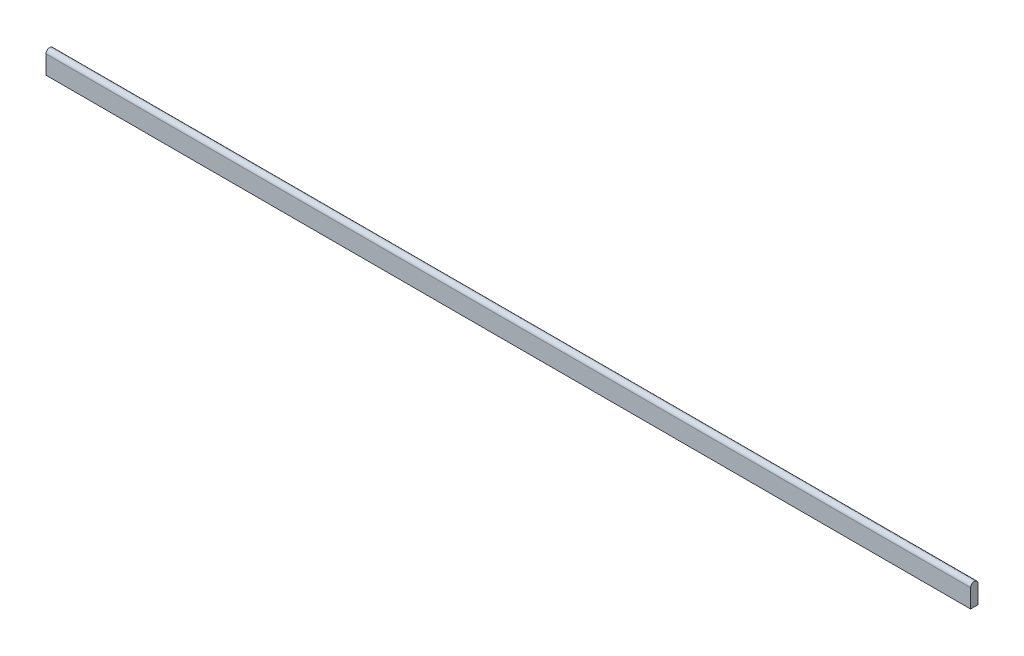
ISO-10303-21;
HEADER;
FILE_DESCRIPTION(('STEP AP214'),'2;1');
FILE_NAME('part.step','',(''),(''),'','','');
FILE_SCHEMA(('AUTOMOTIVE_DESIGN { 1 0 10303 214 1 1 1 1 }'));
ENDSEC;
DATA;
#1=APPLICATION_CONTEXT('core data for automotive mechanical design processes');
#2=APPLICATION_PROTOCOL_DEFINITION('international standard','automotive_design',2000,#1);
#3=PRODUCT_CONTEXT('',#1,'mechanical');
#4=PRODUCT('Part','Part','',(#3));
#5=PRODUCT_RELATED_PRODUCT_CATEGORY('part','',(#4));
#6=PRODUCT_DEFINITION_FORMATION('','',#4);
#7=PRODUCT_DEFINITION_CONTEXT('part definition',#1,'design');
#8=PRODUCT_DEFINITION('design','',#6,#7);
#9=PRODUCT_DEFINITION_SHAPE('','',#8);
#10=(LENGTH_UNIT() NAMED_UNIT(*) SI_UNIT(.MILLI.,.METRE.));
#11=(NAMED_UNIT(*) PLANE_ANGLE_UNIT() SI_UNIT($,.RADIAN.));
#12=(NAMED_UNIT(*) SI_UNIT($,.STERADIAN.) SOLID_ANGLE_UNIT());
#13=UNCERTAINTY_MEASURE_WITH_UNIT(LENGTH_MEASURE(1.E-05),#10,'distance_accuracy_value','');
#14=(GEOMETRIC_REPRESENTATION_CONTEXT(3) GLOBAL_UNCERTAINTY_ASSIGNED_CONTEXT((#13)) GLOBAL_UNIT_ASSIGNED_CONTEXT((#10,
#11,#12)) REPRESENTATION_CONTEXT('',''));
#15=CARTESIAN_POINT('',(0.,0.,0.));
#16=DIRECTION('',(0.,0.,1.));
#17=DIRECTION('',(1.,0.,0.));
#18=AXIS2_PLACEMENT_3D('',#15,#16,#17);
#19=CARTESIAN_POINT('',(500.,0.,0.));
#20=DIRECTION('',(-1.,0.,0.));
#21=DIRECTION('',(0.,0.,1.));
#22=AXIS2_PLACEMENT_3D('',#19,#20,#21);
#23=CYLINDRICAL_SURFACE('',#22,2.);
#24=CARTESIAN_POINT('',(0.,0.,0.));
#25=DIRECTION('',(1.,0.,0.));
#26=DIRECTION('',(0.,0.,1.));
#27=AXIS2_PLACEMENT_3D('',#24,#25,#26);
#28=CIRCLE('',#27,2.);
#29=CARTESIAN_POINT('',(0.,0.,-2.));
#30=VERTEX_POINT('',#29);
#31=CARTESIAN_POINT('',(0.,0.,2.));
#32=VERTEX_POINT('',#31);
#33=EDGE_CURVE('E96',#30,#32,#28,.T.);
#34=ORIENTED_EDGE('',*,*,#33,.T.);
#35=DIRECTION('',(-1.,0.,0.));
#36=VECTOR('',#35,1.);
#37=CARTESIAN_POINT('',(500.,0.,2.));
#38=LINE('',#37,#36);
#39=CARTESIAN_POINT('',(500.,0.,2.));
#40=VERTEX_POINT('',#39);
#41=EDGE_CURVE('E11',#40,#32,#38,.T.);
#42=ORIENTED_EDGE('',*,*,#41,.F.);
#43=CARTESIAN_POINT('',(500.,0.,0.));
#44=DIRECTION('',(1.,0.,0.));
#45=DIRECTION('',(0.,0.,1.));
#46=AXIS2_PLACEMENT_3D('',#43,#44,#45);
#47=CIRCLE('',#46,2.);
#48=CARTESIAN_POINT('',(500.,0.,-2.));
#49=VERTEX_POINT('',#48);
#50=EDGE_CURVE('E84',#49,#40,#47,.T.);
#51=ORIENTED_EDGE('',*,*,#50,.F.);
#52=DIRECTION('',(-1.,0.,0.));
#53=VECTOR('',#52,1.);
#54=CARTESIAN_POINT('',(500.,0.,-2.));
#55=LINE('',#54,#53);
#56=EDGE_CURVE('E92',#49,#30,#55,.T.);
#57=ORIENTED_EDGE('',*,*,#56,.T.);
#58=EDGE_LOOP('',(#34,#42,#51,#57));
#59=FACE_BOUND('',#58,.T.);
#60=ADVANCED_FACE('F33',(#59),#23,.T.);
#61=CARTESIAN_POINT('',(500.,0.,2.));
#62=DIRECTION('',(0.,0.,-1.));
#63=DIRECTION('',(0.,1.,0.));
#64=AXIS2_PLACEMENT_3D('',#61,#62,#63);
#65=PLANE('',#64);
#66=DIRECTION('',(0.,-1.,0.));
#67=VECTOR('',#66,1.);
#68=CARTESIAN_POINT('',(0.,0.,2.));
#69=LINE('',#68,#67);
#70=CARTESIAN_POINT('',(0.,-10.,2.));
#71=VERTEX_POINT('',#70);
#72=EDGE_CURVE('E88',#32,#71,#69,.T.);
#73=ORIENTED_EDGE('',*,*,#72,.T.);
#74=DIRECTION('',(-1.,0.,0.));
#75=VECTOR('',#74,1.);
#76=CARTESIAN_POINT('',(500.,-10.,2.));
#77=LINE('',#76,#75);
#78=CARTESIAN_POINT('',(500.,-10.,2.));
#79=VERTEX_POINT('',#78);
#80=EDGE_CURVE('E41',#79,#71,#77,.T.);
#81=ORIENTED_EDGE('',*,*,#80,.F.);
#82=DIRECTION('',(0.,-1.,0.));
#83=VECTOR('',#82,1.);
#84=CARTESIAN_POINT('',(500.,0.,2.));
#85=LINE('',#84,#83);
#86=EDGE_CURVE('E79',#40,#79,#85,.T.);
#87=ORIENTED_EDGE('',*,*,#86,.F.);
#88=ORIENTED_EDGE('',*,*,#41,.T.);
#89=EDGE_LOOP('',(#73,#81,#87,#88));
#90=FACE_BOUND('',#89,.T.);
#91=ADVANCED_FACE('F87',(#90),#65,.F.);
#92=CARTESIAN_POINT('',(500.,-10.,2.));
#93=DIRECTION('',(0.,1.,0.));
#94=DIRECTION('',(0.,0.,1.));
#95=AXIS2_PLACEMENT_3D('',#92,#93,#94);
#96=PLANE('',#95);
#97=DIRECTION('',(0.,0.,-1.));
#98=VECTOR('',#97,1.);
#99=CARTESIAN_POINT('',(0.,-10.,2.));
#100=LINE('',#99,#98);
#101=CARTESIAN_POINT('',(0.,-10.,-2.));
#102=VERTEX_POINT('',#101);
#103=EDGE_CURVE('E66',#71,#102,#100,.T.);
#104=ORIENTED_EDGE('',*,*,#103,.T.);
#105=DIRECTION('',(-1.,0.,0.));
#106=VECTOR('',#105,1.);
#107=CARTESIAN_POINT('',(500.,-10.,-2.));
#108=LINE('',#107,#106);
#109=CARTESIAN_POINT('',(500.,-10.,-2.));
#110=VERTEX_POINT('',#109);
#111=EDGE_CURVE('E89',#110,#102,#108,.T.);
#112=ORIENTED_EDGE('',*,*,#111,.F.);
#113=DIRECTION('',(0.,0.,-1.));
#114=VECTOR('',#113,1.);
#115=CARTESIAN_POINT('',(500.,-10.,2.));
#116=LINE('',#115,#114);
#117=EDGE_CURVE('E82',#79,#110,#116,.T.);
#118=ORIENTED_EDGE('',*,*,#117,.F.);
#119=ORIENTED_EDGE('',*,*,#80,.T.);
#120=EDGE_LOOP('',(#104,#112,#118,#119));
#121=FACE_BOUND('',#120,.T.);
#122=ADVANCED_FACE('F90',(#121),#96,.F.);
#123=CARTESIAN_POINT('',(500.,-10.,-2.));
#124=DIRECTION('',(0.,0.,1.));
#125=DIRECTION('',(0.,-1.,0.));
#126=AXIS2_PLACEMENT_3D('',#123,#124,#125);
#127=PLANE('',#126);
#128=DIRECTION('',(0.,1.,0.));
#129=VECTOR('',#128,1.);
#130=CARTESIAN_POINT('',(0.,-10.,-2.));
#131=LINE('',#130,#129);
#132=EDGE_CURVE('E72',#102,#30,#131,.T.);
#133=ORIENTED_EDGE('',*,*,#132,.T.);
#134=ORIENTED_EDGE('',*,*,#56,.F.);
#135=DIRECTION('',(0.,1.,0.));
#136=VECTOR('',#135,1.);
#137=CARTESIAN_POINT('',(500.,-10.,-2.));
#138=LINE('',#137,#136);
#139=EDGE_CURVE('E49',#110,#49,#138,.T.);
#140=ORIENTED_EDGE('',*,*,#139,.F.);
#141=ORIENTED_EDGE('',*,*,#111,.T.);
#142=EDGE_LOOP('',(#133,#134,#140,#141));
#143=FACE_BOUND('',#142,.T.);
#144=ADVANCED_FACE('F103',(#143),#127,.F.);
#145=CARTESIAN_POINT('',(500.,0.,0.));
#146=DIRECTION('',(-1.,0.,0.));
#147=DIRECTION('',(0.,0.,1.));
#148=AXIS2_PLACEMENT_3D('',#145,#146,#147);
#149=PLANE('',#148);
#150=ORIENTED_EDGE('',*,*,#50,.T.);
#151=ORIENTED_EDGE('',*,*,#86,.T.);
#152=ORIENTED_EDGE('',*,*,#117,.T.);
#153=ORIENTED_EDGE('',*,*,#139,.T.);
#154=EDGE_LOOP('',(#150,#151,#152,#153));
#155=FACE_BOUND('',#154,.T.);
#156=ADVANCED_FACE('F80',(#155),#149,.F.);
#157=CARTESIAN_POINT('',(0.,0.,0.));
#158=DIRECTION('',(-1.,0.,0.));
#159=DIRECTION('',(0.,0.,1.));
#160=AXIS2_PLACEMENT_3D('',#157,#158,#159);
#161=PLANE('',#160);
#162=ORIENTED_EDGE('',*,*,#33,.F.);
#163=ORIENTED_EDGE('',*,*,#132,.F.);
#164=ORIENTED_EDGE('',*,*,#103,.F.);
#165=ORIENTED_EDGE('',*,*,#72,.F.);
#166=EDGE_LOOP('',(#162,#163,#164,#165));
#167=FACE_BOUND('',#166,.T.);
#168=ADVANCED_FACE('F106',(#167),#161,.T.);
#169=CLOSED_SHELL('',(#60,#91,#122,#144,#156,#168));
#170=MANIFOLD_SOLID_BREP('B2',#169);
#171=ADVANCED_BREP_SHAPE_REPRESENTATION('',(#18,#170),#14);
#172=SHAPE_DEFINITION_REPRESENTATION(#9,#171);
ENDSEC;
END-ISO-10303-21;
